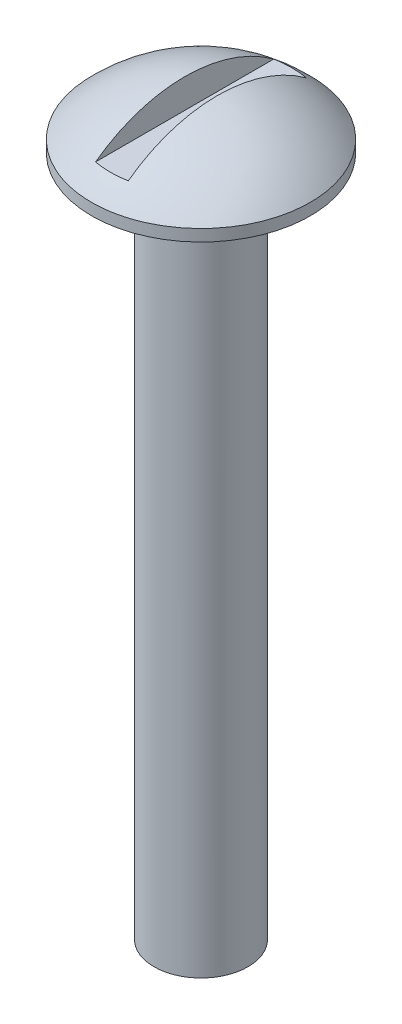
ISO-10303-21;
HEADER;
FILE_DESCRIPTION(('STEP AP214'),'2;1');
FILE_NAME('part.step','',(''),(''),'','','');
FILE_SCHEMA(('AUTOMOTIVE_DESIGN { 1 0 10303 214 1 1 1 1 }'));
ENDSEC;
DATA;
#1=APPLICATION_CONTEXT('core data for automotive mechanical design processes');
#2=APPLICATION_PROTOCOL_DEFINITION('international standard','automotive_design',2000,#1);
#3=PRODUCT_CONTEXT('',#1,'mechanical');
#4=PRODUCT('Part','Part','',(#3));
#5=PRODUCT_RELATED_PRODUCT_CATEGORY('part','',(#4));
#6=PRODUCT_DEFINITION_FORMATION('','',#4);
#7=PRODUCT_DEFINITION_CONTEXT('part definition',#1,'design');
#8=PRODUCT_DEFINITION('design','',#6,#7);
#9=PRODUCT_DEFINITION_SHAPE('','',#8);
#10=(LENGTH_UNIT() NAMED_UNIT(*) SI_UNIT(.MILLI.,.METRE.));
#11=(NAMED_UNIT(*) PLANE_ANGLE_UNIT() SI_UNIT($,.RADIAN.));
#12=(NAMED_UNIT(*) SI_UNIT($,.STERADIAN.) SOLID_ANGLE_UNIT());
#13=UNCERTAINTY_MEASURE_WITH_UNIT(LENGTH_MEASURE(1.E-05),#10,'distance_accuracy_value','');
#14=(GEOMETRIC_REPRESENTATION_CONTEXT(3) GLOBAL_UNCERTAINTY_ASSIGNED_CONTEXT((#13)) GLOBAL_UNIT_ASSIGNED_CONTEXT((#10,
#11,#12)) REPRESENTATION_CONTEXT('',''));
#15=CARTESIAN_POINT('',(0.,0.,0.));
#16=DIRECTION('',(0.,0.,1.));
#17=DIRECTION('',(1.,0.,0.));
#18=AXIS2_PLACEMENT_3D('',#15,#16,#17);
#19=CARTESIAN_POINT('',(0.,-3.44452242732558,0.));
#20=DIRECTION('',(0.,0.,1.));
#21=DIRECTION('',(1.,0.,0.));
#22=AXIS2_PLACEMENT_3D('',#19,#20,#21);
#23=SPHERICAL_SURFACE('',#22,5.62892242732558);
#24=CARTESIAN_POINT('',(0.,0.43688,0.));
#25=DIRECTION('',(0.,1.,0.));
#26=DIRECTION('',(0.,0.,1.));
#27=AXIS2_PLACEMENT_3D('',#24,#25,#26);
#28=CIRCLE('',#27,4.0767);
#29=CARTESIAN_POINT('',(0.,0.43688,-4.0767));
#30=VERTEX_POINT('',#29);
#31=EDGE_CURVE('E78',#30,#30,#28,.T.);
#32=ORIENTED_EDGE('',*,*,#31,.T.);
#33=EDGE_LOOP('',(#32));
#34=FACE_BOUND('',#33,.T.);
#35=CARTESIAN_POINT('',(0.6096,-3.44452242732558,0.));
#36=DIRECTION('',(1.,0.,0.));
#37=DIRECTION('',(0.,0.,-1.));
#38=AXIS2_PLACEMENT_3D('',#35,#36,#37);
#39=CIRCLE('',#38,5.59581589518891);
#40=CARTESIAN_POINT('',(0.6096,1.05909346786333,3.32123462005482));
#41=VERTEX_POINT('',#40);
#42=CARTESIAN_POINT('',(0.6096,1.05909346786333,-3.32123462005482));
#43=VERTEX_POINT('',#42);
#44=EDGE_CURVE('E54',#41,#43,#39,.F.);
#45=ORIENTED_EDGE('',*,*,#44,.F.);
#46=CARTESIAN_POINT('',(0.,1.05909346786333,0.));
#47=DIRECTION('',(0.,1.,0.));
#48=DIRECTION('',(-1.,0.,0.));
#49=AXIS2_PLACEMENT_3D('',#46,#47,#48);
#50=CIRCLE('',#49,3.37671609133055);
#51=CARTESIAN_POINT('',(-0.6096,1.05909346786333,3.32123462005482));
#52=VERTEX_POINT('',#51);
#53=EDGE_CURVE('E66',#41,#52,#50,.F.);
#54=ORIENTED_EDGE('',*,*,#53,.T.);
#55=CARTESIAN_POINT('',(-0.609599999999999,-3.44452242732558,0.));
#56=DIRECTION('',(-1.,0.,0.));
#57=DIRECTION('',(0.,-1.,0.));
#58=AXIS2_PLACEMENT_3D('',#55,#56,#57);
#59=CIRCLE('',#58,5.59581589518891);
#60=CARTESIAN_POINT('',(-0.6096,1.05909346786333,-3.32123462005482));
#61=VERTEX_POINT('',#60);
#62=EDGE_CURVE('E11',#61,#52,#59,.F.);
#63=ORIENTED_EDGE('',*,*,#62,.F.);
#64=CARTESIAN_POINT('',(0.,1.05909346786333,0.));
#65=DIRECTION('',(0.,-1.,0.));
#66=DIRECTION('',(1.,0.,0.));
#67=AXIS2_PLACEMENT_3D('',#64,#65,#66);
#68=CIRCLE('',#67,3.37671609133055);
#69=EDGE_CURVE('E41',#43,#61,#68,.F.);
#70=ORIENTED_EDGE('',*,*,#69,.F.);
#71=EDGE_LOOP('',(#45,#54,#63,#70));
#72=FACE_BOUND('',#71,.T.);
#73=ADVANCED_FACE('F34',(#34,#72),#23,.T.);
#74=CARTESIAN_POINT('',(0.,0.,0.));
#75=DIRECTION('',(0.,1.,0.));
#76=DIRECTION('',(0.,0.,1.));
#77=AXIS2_PLACEMENT_3D('',#74,#75,#76);
#78=PLANE('',#77);
#79=CARTESIAN_POINT('',(0.,0.,0.));
#80=DIRECTION('',(0.,1.,0.));
#81=DIRECTION('',(0.,0.,1.));
#82=AXIS2_PLACEMENT_3D('',#79,#80,#81);
#83=CIRCLE('',#82,4.0767);
#84=CARTESIAN_POINT('',(0.,0.,-4.0767));
#85=VERTEX_POINT('',#84);
#86=EDGE_CURVE('E75',#85,#85,#83,.T.);
#87=ORIENTED_EDGE('',*,*,#86,.F.);
#88=EDGE_LOOP('',(#87));
#89=FACE_BOUND('',#88,.T.);
#90=CARTESIAN_POINT('',(0.,0.,0.));
#91=DIRECTION('',(0.,1.,0.));
#92=DIRECTION('',(0.,0.,1.));
#93=AXIS2_PLACEMENT_3D('',#90,#91,#92);
#94=CIRCLE('',#93,1.7526);
#95=CARTESIAN_POINT('',(0.,0.,1.7526));
#96=VERTEX_POINT('',#95);
#97=EDGE_CURVE('E81',#96,#96,#94,.F.);
#98=ORIENTED_EDGE('',*,*,#97,.F.);
#99=EDGE_LOOP('',(#98));
#100=FACE_BOUND('',#99,.T.);
#101=ADVANCED_FACE('F88',(#89,#100),#78,.F.);
#102=CARTESIAN_POINT('',(0.,0.43688,0.));
#103=DIRECTION('',(0.,-1.,0.));
#104=DIRECTION('',(0.,0.,-1.));
#105=AXIS2_PLACEMENT_3D('',#102,#103,#104);
#106=CYLINDRICAL_SURFACE('',#105,4.0767);
#107=CARTESIAN_POINT('',(0.,0.43688,-4.0767));
#108=CARTESIAN_POINT('',(0.,0.432329166666667,-4.0767));
#109=CARTESIAN_POINT('',(0.,0.427778333333333,-4.0767));
#110=CARTESIAN_POINT('',(0.,0.418676666666667,-4.0767));
#111=CARTESIAN_POINT('',(0.,0.414125833333333,-4.0767));
#112=CARTESIAN_POINT('',(0.,0.405024166666667,-4.0767));
#113=CARTESIAN_POINT('',(0.,0.400473333333333,-4.0767));
#114=CARTESIAN_POINT('',(0.,0.391371666666667,-4.0767));
#115=CARTESIAN_POINT('',(0.,0.386820833333333,-4.0767));
#116=CARTESIAN_POINT('',(0.,0.377719166666667,-4.0767));
#117=CARTESIAN_POINT('',(0.,0.373168333333333,-4.0767));
#118=CARTESIAN_POINT('',(0.,0.364066666666667,-4.0767));
#119=CARTESIAN_POINT('',(0.,0.359515833333333,-4.0767));
#120=CARTESIAN_POINT('',(0.,0.350414166666667,-4.0767));
#121=CARTESIAN_POINT('',(0.,0.345863333333333,-4.0767));
#122=CARTESIAN_POINT('',(0.,0.336761666666667,-4.0767));
#123=CARTESIAN_POINT('',(0.,0.332210833333333,-4.0767));
#124=CARTESIAN_POINT('',(0.,0.323109166666667,-4.0767));
#125=CARTESIAN_POINT('',(0.,0.318558333333333,-4.0767));
#126=CARTESIAN_POINT('',(0.,0.309456666666667,-4.0767));
#127=CARTESIAN_POINT('',(0.,0.304905833333333,-4.0767));
#128=CARTESIAN_POINT('',(0.,0.295804166666667,-4.0767));
#129=CARTESIAN_POINT('',(0.,0.291253333333333,-4.0767));
#130=CARTESIAN_POINT('',(0.,0.282151666666667,-4.0767));
#131=CARTESIAN_POINT('',(0.,0.277600833333333,-4.0767));
#132=CARTESIAN_POINT('',(0.,0.268499166666667,-4.0767));
#133=CARTESIAN_POINT('',(0.,0.263948333333333,-4.0767));
#134=CARTESIAN_POINT('',(0.,0.254846666666667,-4.0767));
#135=CARTESIAN_POINT('',(0.,0.250295833333333,-4.0767));
#136=CARTESIAN_POINT('',(0.,0.241194166666667,-4.0767));
#137=CARTESIAN_POINT('',(0.,0.236643333333333,-4.0767));
#138=CARTESIAN_POINT('',(0.,0.227541666666667,-4.0767));
#139=CARTESIAN_POINT('',(0.,0.222990833333333,-4.0767));
#140=CARTESIAN_POINT('',(0.,0.213889166666667,-4.0767));
#141=CARTESIAN_POINT('',(0.,0.209338333333333,-4.0767));
#142=CARTESIAN_POINT('',(0.,0.200236666666667,-4.0767));
#143=CARTESIAN_POINT('',(0.,0.195685833333333,-4.0767));
#144=CARTESIAN_POINT('',(0.,0.186584166666667,-4.0767));
#145=CARTESIAN_POINT('',(0.,0.182033333333333,-4.0767));
#146=CARTESIAN_POINT('',(0.,0.172931666666667,-4.0767));
#147=CARTESIAN_POINT('',(0.,0.168380833333333,-4.0767));
#148=CARTESIAN_POINT('',(0.,0.159279166666667,-4.0767));
#149=CARTESIAN_POINT('',(0.,0.154728333333333,-4.0767));
#150=CARTESIAN_POINT('',(0.,0.145626666666667,-4.0767));
#151=CARTESIAN_POINT('',(0.,0.141075833333333,-4.0767));
#152=CARTESIAN_POINT('',(0.,0.131974166666667,-4.0767));
#153=CARTESIAN_POINT('',(0.,0.127423333333333,-4.0767));
#154=CARTESIAN_POINT('',(0.,0.118321666666667,-4.0767));
#155=CARTESIAN_POINT('',(0.,0.113770833333333,-4.0767));
#156=CARTESIAN_POINT('',(0.,0.104669166666667,-4.0767));
#157=CARTESIAN_POINT('',(0.,0.100118333333333,-4.0767));
#158=CARTESIAN_POINT('',(0.,0.0910166666666667,-4.0767));
#159=CARTESIAN_POINT('',(0.,0.0864658333333334,-4.0767));
#160=CARTESIAN_POINT('',(0.,0.0773641666666667,-4.0767));
#161=CARTESIAN_POINT('',(0.,0.0728133333333333,-4.0767));
#162=CARTESIAN_POINT('',(0.,0.0637116666666667,-4.0767));
#163=CARTESIAN_POINT('',(0.,0.0591608333333333,-4.0767));
#164=CARTESIAN_POINT('',(0.,0.0500591666666667,-4.0767));
#165=CARTESIAN_POINT('',(0.,0.0455083333333333,-4.0767));
#166=CARTESIAN_POINT('',(0.,0.0364066666666667,-4.0767));
#167=CARTESIAN_POINT('',(0.,0.0318558333333333,-4.0767));
#168=CARTESIAN_POINT('',(0.,0.0227541666666667,-4.0767));
#169=CARTESIAN_POINT('',(0.,0.0182033333333333,-4.0767));
#170=CARTESIAN_POINT('',(0.,0.00910166666666668,-4.0767));
#171=CARTESIAN_POINT('',(0.,0.00455083333333335,-4.0767));
#172=CARTESIAN_POINT('',(0.,0.,-4.0767));
#173=B_SPLINE_CURVE_WITH_KNOTS('',3,(#107,#108,#109,#110,#111,#112,#113,#114,#115,#116,#117,
#118,#119,#120,#121,#122,#123,#124,#125,#126,#127,#128,#129,#130,#131,#132,#133,#134,#135,#136,
#137,#138,#139,#140,#141,#142,#143,#144,#145,#146,#147,#148,#149,#150,#151,#152,#153,#154,#155,
#156,#157,#158,#159,#160,#161,#162,#163,#164,#165,#166,#167,#168,#169,#170,#171,#172),
.UNSPECIFIED.,.F.,.F.,(4,2,2,2,2,2,2,2,2,2,2,2,2,2,2,2,2,2,2,2,2,2,2,2,2,2,2,2,2,2,2,2,4),(0.,
0.0136525,0.027305,0.0409575,0.05461,0.0682625,0.081915,0.0955675,0.10922,0.1228725,0.136525,
0.1501775,0.16383,0.1774825,0.191135,0.2047875,0.21844,0.2320925,0.245745,0.2593975,0.27305,
0.2867025,0.300355,0.3140075,0.32766,0.3413125,0.354965,0.3686175,0.38227,0.3959225,0.409575,
0.4232275,0.43688),.UNSPECIFIED.);
#174=EDGE_CURVE('BSEAM90',#30,#85,#173,.T.);
#175=ORIENTED_EDGE('',*,*,#31,.F.);
#176=ORIENTED_EDGE('',*,*,#86,.T.);
#177=ORIENTED_EDGE('',*,*,#174,.T.);
#178=ORIENTED_EDGE('',*,*,#174,.F.);
#179=EDGE_LOOP('',(#175,#177,#176,#178));
#180=FACE_BOUND('',#179,.T.);
#181=ADVANCED_FACE('F90',(#180),#106,.T.);
#182=CARTESIAN_POINT('',(0.,-25.4,0.));
#183=DIRECTION('',(0.,1.,0.));
#184=DIRECTION('',(0.,0.,1.));
#185=AXIS2_PLACEMENT_3D('',#182,#183,#184);
#186=CYLINDRICAL_SURFACE('',#185,1.7526);
#187=CARTESIAN_POINT('',(0.,-25.4,0.));
#188=DIRECTION('',(0.,-1.,0.));
#189=DIRECTION('',(0.,0.,-1.));
#190=AXIS2_PLACEMENT_3D('',#187,#188,#189);
#191=CIRCLE('',#190,1.7526);
#192=CARTESIAN_POINT('',(0.,-25.4,-1.7526));
#193=VERTEX_POINT('',#192);
#194=EDGE_CURVE('E67',#193,#193,#191,.T.);
#195=ORIENTED_EDGE('',*,*,#194,.F.);
#196=EDGE_LOOP('',(#195));
#197=FACE_BOUND('',#196,.T.);
#198=ORIENTED_EDGE('',*,*,#97,.T.);
#199=EDGE_LOOP('',(#198));
#200=FACE_BOUND('',#199,.T.);
#201=ADVANCED_FACE('F86',(#197,#200),#186,.T.);
#202=CARTESIAN_POINT('',(0.,-25.4,0.));
#203=DIRECTION('',(0.,-1.,0.));
#204=DIRECTION('',(0.,0.,-1.));
#205=AXIS2_PLACEMENT_3D('',#202,#203,#204);
#206=PLANE('',#205);
#207=ORIENTED_EDGE('',*,*,#194,.T.);
#208=EDGE_LOOP('',(#207));
#209=FACE_BOUND('',#208,.T.);
#210=ADVANCED_FACE('F103',(#209),#206,.T.);
#211=CARTESIAN_POINT('',(-0.6096,1.05909346786333,-4.0767));
#212=DIRECTION('',(0.,-1.,0.));
#213=DIRECTION('',(1.,0.,0.));
#214=AXIS2_PLACEMENT_3D('',#211,#212,#213);
#215=PLANE('',#214);
#216=ORIENTED_EDGE('',*,*,#69,.T.);
#217=DIRECTION('',(0.,0.,1.));
#218=VECTOR('',#217,1.);
#219=CARTESIAN_POINT('',(-0.6096,1.05909346786333,-4.0767));
#220=LINE('',#219,#218);
#221=EDGE_CURVE('E61',#61,#52,#220,.T.);
#222=ORIENTED_EDGE('',*,*,#221,.T.);
#223=ORIENTED_EDGE('',*,*,#53,.F.);
#224=DIRECTION('',(0.,0.,1.));
#225=VECTOR('',#224,1.);
#226=CARTESIAN_POINT('',(0.6096,1.05909346786333,-4.0767));
#227=LINE('',#226,#225);
#228=EDGE_CURVE('E68',#43,#41,#227,.T.);
#229=ORIENTED_EDGE('',*,*,#228,.F.);
#230=EDGE_LOOP('',(#216,#222,#223,#229));
#231=FACE_BOUND('',#230,.T.);
#232=ADVANCED_FACE('F65',(#231),#215,.F.);
#233=CARTESIAN_POINT('',(-0.6096,2.15129346786333,-4.0767));
#234=DIRECTION('',(-1.,0.,0.));
#235=DIRECTION('',(0.,-1.,0.));
#236=AXIS2_PLACEMENT_3D('',#233,#234,#235);
#237=PLANE('',#236);
#238=ORIENTED_EDGE('',*,*,#62,.T.);
#239=ORIENTED_EDGE('',*,*,#221,.F.);
#240=EDGE_LOOP('',(#238,#239));
#241=FACE_BOUND('',#240,.T.);
#242=ADVANCED_FACE('F60',(#241),#237,.F.);
#243=CARTESIAN_POINT('',(0.6096,2.15129346786333,-4.0767));
#244=DIRECTION('',(1.,0.,0.));
#245=DIRECTION('',(0.,0.,-1.));
#246=AXIS2_PLACEMENT_3D('',#243,#244,#245);
#247=PLANE('',#246);
#248=ORIENTED_EDGE('',*,*,#44,.T.);
#249=ORIENTED_EDGE('',*,*,#228,.T.);
#250=EDGE_LOOP('',(#248,#249));
#251=FACE_BOUND('',#250,.T.);
#252=ADVANCED_FACE('F110',(#251),#247,.F.);
#253=CLOSED_SHELL('',(#73,#101,#181,#201,#210,#232,#242,#252));
#254=MANIFOLD_SOLID_BREP('B2',#253);
#255=ADVANCED_BREP_SHAPE_REPRESENTATION('',(#18,#254),#14);
#256=SHAPE_DEFINITION_REPRESENTATION(#9,#255);
ENDSEC;
END-ISO-10303-21;
